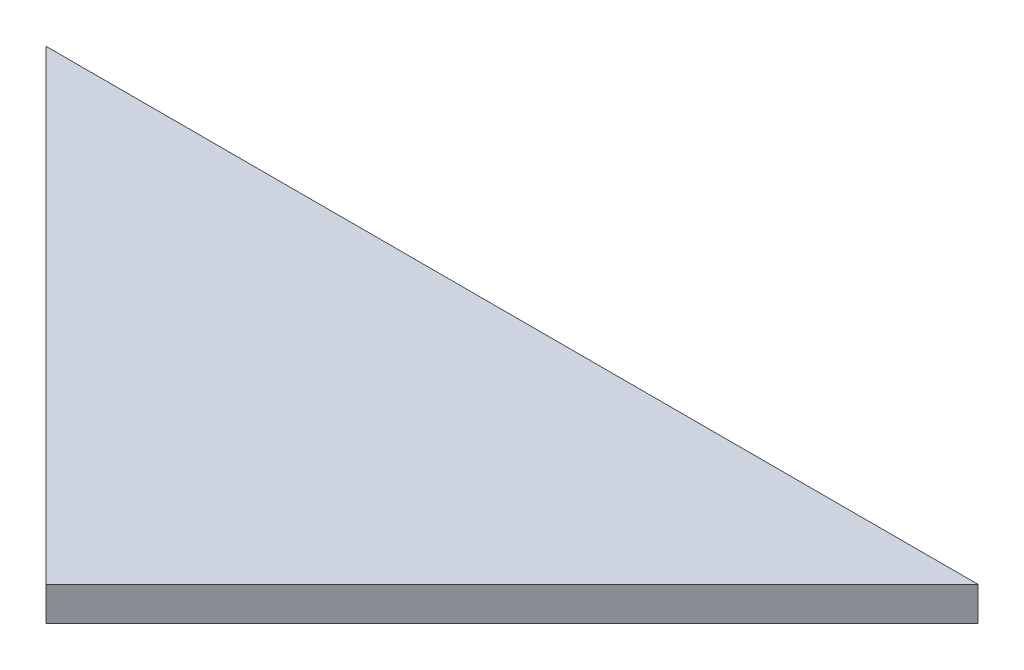
ISO-10303-21;
HEADER;
FILE_DESCRIPTION(('STEP AP214'),'2;1');
FILE_NAME('part.step','',(''),(''),'','','');
FILE_SCHEMA(('AUTOMOTIVE_DESIGN { 1 0 10303 214 1 1 1 1 }'));
ENDSEC;
DATA;
#1=APPLICATION_CONTEXT('core data for automotive mechanical design processes');
#2=APPLICATION_PROTOCOL_DEFINITION('international standard','automotive_design',2000,#1);
#3=PRODUCT_CONTEXT('',#1,'mechanical');
#4=PRODUCT('Part','Part','',(#3));
#5=PRODUCT_RELATED_PRODUCT_CATEGORY('part','',(#4));
#6=PRODUCT_DEFINITION_FORMATION('','',#4);
#7=PRODUCT_DEFINITION_CONTEXT('part definition',#1,'design');
#8=PRODUCT_DEFINITION('design','',#6,#7);
#9=PRODUCT_DEFINITION_SHAPE('','',#8);
#10=(LENGTH_UNIT() NAMED_UNIT(*) SI_UNIT(.MILLI.,.METRE.));
#11=(NAMED_UNIT(*) PLANE_ANGLE_UNIT() SI_UNIT($,.RADIAN.));
#12=(NAMED_UNIT(*) SI_UNIT($,.STERADIAN.) SOLID_ANGLE_UNIT());
#13=UNCERTAINTY_MEASURE_WITH_UNIT(LENGTH_MEASURE(1.E-05),#10,'distance_accuracy_value','');
#14=(GEOMETRIC_REPRESENTATION_CONTEXT(3) GLOBAL_UNCERTAINTY_ASSIGNED_CONTEXT((#13)) GLOBAL_UNIT_ASSIGNED_CONTEXT((#10,
#11,#12)) REPRESENTATION_CONTEXT('',''));
#15=CARTESIAN_POINT('',(0.,0.,0.));
#16=DIRECTION('',(0.,0.,1.));
#17=DIRECTION('',(1.,0.,0.));
#18=AXIS2_PLACEMENT_3D('',#15,#16,#17);
#19=CARTESIAN_POINT('',(0.,-115.204878,157.21087812715));
#20=DIRECTION('',(0.707106781186547,0.,-0.707106781186548));
#21=DIRECTION('',(-0.707106781186548,0.,-0.707106781186547));
#22=AXIS2_PLACEMENT_3D('',#19,#20,#21);
#23=PLANE('',#22);
#24=DIRECTION('',(-0.707106781186548,0.,-0.707106781186547));
#25=VECTOR('',#24,1.);
#26=CARTESIAN_POINT('',(0.,-112.204878,157.21087812715));
#27=LINE('',#26,#25);
#28=CARTESIAN_POINT('',(0.,-112.204878,157.21087812715));
#29=VERTEX_POINT('',#28);
#30=CARTESIAN_POINT('',(-40.9660001271505,-112.204878,116.244878));
#31=VERTEX_POINT('',#30);
#32=EDGE_CURVE('E88',#29,#31,#27,.T.);
#33=ORIENTED_EDGE('',*,*,#32,.T.);
#34=DIRECTION('',(0.,1.,0.));
#35=VECTOR('',#34,1.);
#36=CARTESIAN_POINT('',(-40.9660001271505,-115.204878,116.244878));
#37=LINE('',#36,#35);
#38=CARTESIAN_POINT('',(-40.9660001271505,-115.204878,116.244878));
#39=VERTEX_POINT('',#38);
#40=EDGE_CURVE('E11',#39,#31,#37,.T.);
#41=ORIENTED_EDGE('',*,*,#40,.F.);
#42=DIRECTION('',(-0.707106781186548,0.,-0.707106781186547));
#43=VECTOR('',#42,1.);
#44=CARTESIAN_POINT('',(0.,-115.204878,157.21087812715));
#45=LINE('',#44,#43);
#46=CARTESIAN_POINT('',(0.,-115.204878,157.21087812715));
#47=VERTEX_POINT('',#46);
#48=EDGE_CURVE('E80',#47,#39,#45,.T.);
#49=ORIENTED_EDGE('',*,*,#48,.F.);
#50=DIRECTION('',(0.,1.,0.));
#51=VECTOR('',#50,1.);
#52=CARTESIAN_POINT('',(0.,-115.204878,157.21087812715));
#53=LINE('',#52,#51);
#54=EDGE_CURVE('E89',#47,#29,#53,.T.);
#55=ORIENTED_EDGE('',*,*,#54,.T.);
#56=EDGE_LOOP('',(#33,#41,#49,#55));
#57=FACE_BOUND('',#56,.T.);
#58=ADVANCED_FACE('F37',(#57),#23,.F.);
#59=CARTESIAN_POINT('',(-40.9660001271505,-115.204878,116.244878));
#60=DIRECTION('',(0.,0.,1.));
#61=DIRECTION('',(1.,0.,0.));
#62=AXIS2_PLACEMENT_3D('',#59,#60,#61);
#63=PLANE('',#62);
#64=DIRECTION('',(1.,0.,0.));
#65=VECTOR('',#64,1.);
#66=CARTESIAN_POINT('',(-40.9660001271505,-112.204878,116.244878));
#67=LINE('',#66,#65);
#68=CARTESIAN_POINT('',(40.9660001271504,-112.204878,116.244878));
#69=VERTEX_POINT('',#68);
#70=EDGE_CURVE('E67',#31,#69,#67,.T.);
#71=ORIENTED_EDGE('',*,*,#70,.T.);
#72=DIRECTION('',(0.,1.,0.));
#73=VECTOR('',#72,1.);
#74=CARTESIAN_POINT('',(40.9660001271504,-115.204878,116.244878));
#75=LINE('',#74,#73);
#76=CARTESIAN_POINT('',(40.9660001271504,-115.204878,116.244878));
#77=VERTEX_POINT('',#76);
#78=EDGE_CURVE('E45',#77,#69,#75,.T.);
#79=ORIENTED_EDGE('',*,*,#78,.F.);
#80=DIRECTION('',(1.,0.,0.));
#81=VECTOR('',#80,1.);
#82=CARTESIAN_POINT('',(-40.9660001271505,-115.204878,116.244878));
#83=LINE('',#82,#81);
#84=EDGE_CURVE('E75',#39,#77,#83,.T.);
#85=ORIENTED_EDGE('',*,*,#84,.F.);
#86=ORIENTED_EDGE('',*,*,#40,.T.);
#87=EDGE_LOOP('',(#71,#79,#85,#86));
#88=FACE_BOUND('',#87,.T.);
#89=ADVANCED_FACE('F76',(#88),#63,.F.);
#90=CARTESIAN_POINT('',(40.9660001271504,-115.204878,116.244878));
#91=DIRECTION('',(-0.707106781186547,0.,-0.707106781186548));
#92=DIRECTION('',(-0.707106781186548,0.,0.707106781186547));
#93=AXIS2_PLACEMENT_3D('',#90,#91,#92);
#94=PLANE('',#93);
#95=DIRECTION('',(-0.707106781186548,0.,0.707106781186547));
#96=VECTOR('',#95,1.);
#97=CARTESIAN_POINT('',(40.9660001271504,-112.204878,116.244878));
#98=LINE('',#97,#96);
#99=EDGE_CURVE('E72',#69,#29,#98,.T.);
#100=ORIENTED_EDGE('',*,*,#99,.T.);
#101=ORIENTED_EDGE('',*,*,#54,.F.);
#102=DIRECTION('',(-0.707106781186548,0.,0.707106781186547));
#103=VECTOR('',#102,1.);
#104=CARTESIAN_POINT('',(40.9660001271504,-115.204878,116.244878));
#105=LINE('',#104,#103);
#106=EDGE_CURVE('E55',#77,#47,#105,.T.);
#107=ORIENTED_EDGE('',*,*,#106,.F.);
#108=ORIENTED_EDGE('',*,*,#78,.T.);
#109=EDGE_LOOP('',(#100,#101,#107,#108));
#110=FACE_BOUND('',#109,.T.);
#111=ADVANCED_FACE('F100',(#110),#94,.F.);
#112=CARTESIAN_POINT('',(0.,-115.204878,0.));
#113=DIRECTION('',(0.,1.,0.));
#114=DIRECTION('',(0.,0.,1.));
#115=AXIS2_PLACEMENT_3D('',#112,#113,#114);
#116=PLANE('',#115);
#117=ORIENTED_EDGE('',*,*,#48,.T.);
#118=ORIENTED_EDGE('',*,*,#84,.T.);
#119=ORIENTED_EDGE('',*,*,#106,.T.);
#120=EDGE_LOOP('',(#117,#118,#119));
#121=FACE_BOUND('',#120,.T.);
#122=ADVANCED_FACE('F83',(#121),#116,.F.);
#123=CARTESIAN_POINT('',(0.,-112.204878,0.));
#124=DIRECTION('',(0.,1.,0.));
#125=DIRECTION('',(0.,0.,1.));
#126=AXIS2_PLACEMENT_3D('',#123,#124,#125);
#127=PLANE('',#126);
#128=ORIENTED_EDGE('',*,*,#32,.F.);
#129=ORIENTED_EDGE('',*,*,#99,.F.);
#130=ORIENTED_EDGE('',*,*,#70,.F.);
#131=EDGE_LOOP('',(#128,#129,#130));
#132=FACE_BOUND('',#131,.T.);
#133=ADVANCED_FACE('F101',(#132),#127,.T.);
#134=CLOSED_SHELL('',(#58,#89,#111,#122,#133));
#135=MANIFOLD_SOLID_BREP('B2',#134);
#136=ADVANCED_BREP_SHAPE_REPRESENTATION('',(#18,#135),#14);
#137=SHAPE_DEFINITION_REPRESENTATION(#9,#136);
ENDSEC;
END-ISO-10303-21;
